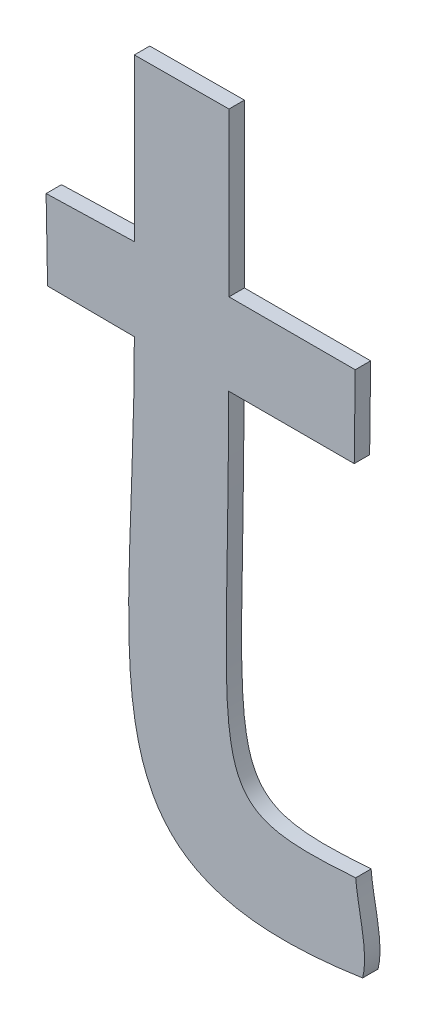
ISO-10303-21;
HEADER;
FILE_DESCRIPTION(('STEP AP214'),'2;1');
FILE_NAME('part.step','',(''),(''),'','','');
FILE_SCHEMA(('AUTOMOTIVE_DESIGN { 1 0 10303 214 1 1 1 1 }'));
ENDSEC;
DATA;
#1=APPLICATION_CONTEXT('core data for automotive mechanical design processes');
#2=APPLICATION_PROTOCOL_DEFINITION('international standard','automotive_design',2000,#1);
#3=PRODUCT_CONTEXT('',#1,'mechanical');
#4=PRODUCT('Part','Part','',(#3));
#5=PRODUCT_RELATED_PRODUCT_CATEGORY('part','',(#4));
#6=PRODUCT_DEFINITION_FORMATION('','',#4);
#7=PRODUCT_DEFINITION_CONTEXT('part definition',#1,'design');
#8=PRODUCT_DEFINITION('design','',#6,#7);
#9=PRODUCT_DEFINITION_SHAPE('','',#8);
#10=(LENGTH_UNIT() NAMED_UNIT(*) SI_UNIT(.MILLI.,.METRE.));
#11=(NAMED_UNIT(*) PLANE_ANGLE_UNIT() SI_UNIT($,.RADIAN.));
#12=(NAMED_UNIT(*) SI_UNIT($,.STERADIAN.) SOLID_ANGLE_UNIT());
#13=UNCERTAINTY_MEASURE_WITH_UNIT(LENGTH_MEASURE(1.E-05),#10,'distance_accuracy_value','');
#14=(GEOMETRIC_REPRESENTATION_CONTEXT(3) GLOBAL_UNCERTAINTY_ASSIGNED_CONTEXT((#13)) GLOBAL_UNIT_ASSIGNED_CONTEXT((#10,
#11,#12)) REPRESENTATION_CONTEXT('',''));
#15=CARTESIAN_POINT('',(0.,0.,0.));
#16=DIRECTION('',(0.,0.,1.));
#17=DIRECTION('',(1.,0.,0.));
#18=AXIS2_PLACEMENT_3D('',#15,#16,#17);
#19=CARTESIAN_POINT('',(-1.914125859375,-48.6386512109375,0.001));
#20=CARTESIAN_POINT('',(-1.914125859375,-48.6386512109375,0.));
#21=CARTESIAN_POINT('',(-1.9137099609375,-48.637019609375,0.001));
#22=CARTESIAN_POINT('',(-1.9137099609375,-48.637019609375,0.));
#23=CARTESIAN_POINT('',(-1.91444578125,-48.6349401171875,0.001));
#24=CARTESIAN_POINT('',(-1.91444578125,-48.6349401171875,0.));
#25=CARTESIAN_POINT('',(-1.91457375,-48.63324453125,0.001));
#26=CARTESIAN_POINT('',(-1.91457375,-48.63324453125,0.));
#27=B_SPLINE_SURFACE_WITH_KNOTS('',3,1,((#19,#20),(#21,#22),(#23,#24),(#25,#26)),.UNSPECIFIED.,
.F.,.F.,.F.,(4,4),(2,2),(0.153846153846154,0.230769230769231),(0.,1.),.UNSPECIFIED.);
#28=CARTESIAN_POINT('',(-1.914125859375,-48.6386512109375,0.));
#29=CARTESIAN_POINT('',(-1.9137099609375,-48.637019609375,0.));
#30=CARTESIAN_POINT('',(-1.91444578125,-48.6349401171875,0.));
#31=CARTESIAN_POINT('',(-1.91457375,-48.63324453125,0.));
#32=B_SPLINE_CURVE_WITH_KNOTS('',3,(#28,#29,#30,#31),.UNSPECIFIED.,.F.,.F.,(4,4),
(0.153846153846154,0.230769230769231),.UNSPECIFIED.);
#33=CARTESIAN_POINT('',(-1.914125859375,-48.6386512109375,0.));
#34=VERTEX_POINT('',#33);
#35=CARTESIAN_POINT('',(-1.91457375,-48.63324453125,0.));
#36=VERTEX_POINT('',#35);
#37=EDGE_CURVE('E11',#34,#36,#32,.T.);
#38=DIRECTION('',(0.,0.,-1.));
#39=VECTOR('',#38,1.);
#40=CARTESIAN_POINT('',(-1.91457375,-48.63324453125,0.001));
#41=LINE('',#40,#39);
#42=CARTESIAN_POINT('',(-1.91457375,-48.63324453125,0.001));
#43=VERTEX_POINT('',#42);
#44=EDGE_CURVE('E28',#43,#36,#41,.T.);
#45=CARTESIAN_POINT('',(-1.914125859375,-48.6386512109375,0.001));
#46=CARTESIAN_POINT('',(-1.9137099609375,-48.637019609375,0.001));
#47=CARTESIAN_POINT('',(-1.91444578125,-48.6349401171875,0.001));
#48=CARTESIAN_POINT('',(-1.91457375,-48.63324453125,0.001));
#49=B_SPLINE_CURVE_WITH_KNOTS('',3,(#45,#46,#47,#48),.UNSPECIFIED.,.F.,.F.,(4,4),
(0.153846153846154,0.230769230769231),.UNSPECIFIED.);
#50=CARTESIAN_POINT('',(-1.914125859375,-48.6386512109375,0.001));
#51=VERTEX_POINT('',#50);
#52=EDGE_CURVE('E223',#51,#43,#49,.T.);
#53=DIRECTION('',(0.,0.,-1.));
#54=VECTOR('',#53,1.);
#55=CARTESIAN_POINT('',(-1.914125859375,-48.6386512109375,0.001));
#56=LINE('',#55,#54);
#57=EDGE_CURVE('E40',#51,#34,#56,.T.);
#58=ORIENTED_EDGE('',*,*,#37,.T.);
#59=ORIENTED_EDGE('',*,*,#44,.F.);
#60=ORIENTED_EDGE('',*,*,#52,.F.);
#61=ORIENTED_EDGE('',*,*,#57,.T.);
#62=EDGE_LOOP('',(#58,#59,#60,#61));
#63=FACE_BOUND('',#62,.T.);
#64=ADVANCED_FACE('F17',(#63),#27,.F.);
#65=CARTESIAN_POINT('',(-1.91457375,-48.63324453125,0.001));
#66=CARTESIAN_POINT('',(-1.91457375,-48.63324453125,0.));
#67=CARTESIAN_POINT('',(-1.924875234375,-48.6339803515625,0.001));
#68=CARTESIAN_POINT('',(-1.924875234375,-48.6339803515625,0.));
#69=CARTESIAN_POINT('',(-1.9227957421875,-48.632284765625,0.001));
#70=CARTESIAN_POINT('',(-1.9227957421875,-48.632284765625,0.));
#71=CARTESIAN_POINT('',(-1.922827734375,-48.610018203125,0.001));
#72=CARTESIAN_POINT('',(-1.922827734375,-48.610018203125,0.));
#73=B_SPLINE_SURFACE_WITH_KNOTS('',3,1,((#65,#66),(#67,#68),(#69,#70),(#71,#72)),.UNSPECIFIED.,
.F.,.F.,.F.,(4,4),(2,2),(0.230769230769231,0.307692307692308),(0.,1.),.UNSPECIFIED.);
#74=CARTESIAN_POINT('',(-1.91457375,-48.63324453125,0.));
#75=CARTESIAN_POINT('',(-1.924875234375,-48.6339803515625,0.));
#76=CARTESIAN_POINT('',(-1.9227957421875,-48.632284765625,0.));
#77=CARTESIAN_POINT('',(-1.922827734375,-48.610018203125,0.));
#78=B_SPLINE_CURVE_WITH_KNOTS('',3,(#74,#75,#76,#77),.UNSPECIFIED.,.F.,.F.,(4,4),
(0.230769230769231,0.307692307692308),.UNSPECIFIED.);
#79=CARTESIAN_POINT('',(-1.922827734375,-48.610018203125,0.));
#80=VERTEX_POINT('',#79);
#81=EDGE_CURVE('E215',#36,#80,#78,.T.);
#82=DIRECTION('',(0.,0.,-1.));
#83=VECTOR('',#82,1.);
#84=CARTESIAN_POINT('',(-1.922827734375,-48.610018203125,0.001));
#85=LINE('',#84,#83);
#86=CARTESIAN_POINT('',(-1.922827734375,-48.610018203125,0.001));
#87=VERTEX_POINT('',#86);
#88=EDGE_CURVE('E210',#87,#80,#85,.T.);
#89=CARTESIAN_POINT('',(-1.91457375,-48.63324453125,0.001));
#90=CARTESIAN_POINT('',(-1.924875234375,-48.6339803515625,0.001));
#91=CARTESIAN_POINT('',(-1.9227957421875,-48.632284765625,0.001));
#92=CARTESIAN_POINT('',(-1.922827734375,-48.610018203125,0.001));
#93=B_SPLINE_CURVE_WITH_KNOTS('',3,(#89,#90,#91,#92),.UNSPECIFIED.,.F.,.F.,(4,4),
(0.230769230769231,0.307692307692308),.UNSPECIFIED.);
#94=EDGE_CURVE('E206',#43,#87,#93,.T.);
#95=ORIENTED_EDGE('',*,*,#81,.T.);
#96=ORIENTED_EDGE('',*,*,#88,.F.);
#97=ORIENTED_EDGE('',*,*,#94,.F.);
#98=ORIENTED_EDGE('',*,*,#44,.T.);
#99=EDGE_LOOP('',(#95,#96,#97,#98));
#100=FACE_BOUND('',#99,.T.);
#101=ADVANCED_FACE('F231',(#100),#73,.F.);
#102=CARTESIAN_POINT('',(0.,-48.610018203125,0.001));
#103=DIRECTION('',(0.,1.,0.));
#104=DIRECTION('',(0.,0.,1.));
#105=AXIS2_PLACEMENT_3D('',#102,#103,#104);
#106=PLANE('',#105);
#107=DIRECTION('',(1.,0.,0.));
#108=VECTOR('',#107,1.);
#109=CARTESIAN_POINT('',(0.,-48.610018203125,0.));
#110=LINE('',#109,#108);
#111=CARTESIAN_POINT('',(-1.9146697265625,-48.610018203125,0.));
#112=VERTEX_POINT('',#111);
#113=EDGE_CURVE('E204',#80,#112,#110,.T.);
#114=ORIENTED_EDGE('',*,*,#113,.T.);
#115=DIRECTION('',(0.,0.,-1.));
#116=VECTOR('',#115,1.);
#117=CARTESIAN_POINT('',(-1.9146697265625,-48.610018203125,0.001));
#118=LINE('',#117,#116);
#119=CARTESIAN_POINT('',(-1.9146697265625,-48.610018203125,0.001));
#120=VERTEX_POINT('',#119);
#121=EDGE_CURVE('E201',#120,#112,#118,.T.);
#122=ORIENTED_EDGE('',*,*,#121,.F.);
#123=DIRECTION('',(1.,0.,0.));
#124=VECTOR('',#123,1.);
#125=CARTESIAN_POINT('',(0.,-48.610018203125,0.001));
#126=LINE('',#125,#124);
#127=EDGE_CURVE('E198',#87,#120,#126,.T.);
#128=ORIENTED_EDGE('',*,*,#127,.F.);
#129=ORIENTED_EDGE('',*,*,#88,.T.);
#130=EDGE_LOOP('',(#114,#122,#128,#129));
#131=FACE_BOUND('',#130,.T.);
#132=ADVANCED_FACE('F235',(#131),#106,.F.);
#133=CARTESIAN_POINT('',(-1.3288139674007,0.0160098068363072,0.001));
#134=DIRECTION('',(-0.999927428426189,0.0120473184148894,0.));
#135=DIRECTION('',(-0.0120473184148894,-0.999927428426189,0.));
#136=AXIS2_PLACEMENT_3D('',#133,#134,#135);
#137=PLANE('',#136);
#138=DIRECTION('',(0.0120473184148894,0.999927428426189,0.));
#139=VECTOR('',#138,1.);
#140=CARTESIAN_POINT('',(-1.3288139674007,0.0160098068363072,0.));
#141=LINE('',#140,#139);
#142=CARTESIAN_POINT('',(-1.9146057421875,-48.6047075,0.));
#143=VERTEX_POINT('',#142);
#144=EDGE_CURVE('E196',#112,#143,#141,.T.);
#145=ORIENTED_EDGE('',*,*,#144,.T.);
#146=DIRECTION('',(0.,0.,-1.));
#147=VECTOR('',#146,1.);
#148=CARTESIAN_POINT('',(-1.9146057421875,-48.6047075,0.001));
#149=LINE('',#148,#147);
#150=CARTESIAN_POINT('',(-1.9146057421875,-48.6047075,0.001));
#151=VERTEX_POINT('',#150);
#152=EDGE_CURVE('E193',#151,#143,#149,.T.);
#153=ORIENTED_EDGE('',*,*,#152,.F.);
#154=DIRECTION('',(0.0120473184148894,0.999927428426189,0.));
#155=VECTOR('',#154,1.);
#156=CARTESIAN_POINT('',(-1.3288139674007,0.0160098068363072,0.001));
#157=LINE('',#156,#155);
#158=EDGE_CURVE('E190',#120,#151,#157,.T.);
#159=ORIENTED_EDGE('',*,*,#158,.F.);
#160=ORIENTED_EDGE('',*,*,#121,.T.);
#161=EDGE_LOOP('',(#145,#153,#159,#160));
#162=FACE_BOUND('',#161,.T.);
#163=ADVANCED_FACE('F239',(#162),#137,.F.);
#164=CARTESIAN_POINT('',(0.,-48.6047075,0.001));
#165=DIRECTION('',(0.,-1.,0.));
#166=DIRECTION('',(0.,0.,-1.));
#167=AXIS2_PLACEMENT_3D('',#164,#165,#166);
#168=PLANE('',#167);
#169=DIRECTION('',(-1.,0.,0.));
#170=VECTOR('',#169,1.);
#171=CARTESIAN_POINT('',(0.,-48.6047075,0.));
#172=LINE('',#171,#170);
#173=CARTESIAN_POINT('',(-1.9227957421875,-48.6047075,0.));
#174=VERTEX_POINT('',#173);
#175=EDGE_CURVE('E188',#143,#174,#172,.T.);
#176=ORIENTED_EDGE('',*,*,#175,.T.);
#177=DIRECTION('',(0.,0.,-1.));
#178=VECTOR('',#177,1.);
#179=CARTESIAN_POINT('',(-1.9227957421875,-48.6047075,0.001));
#180=LINE('',#179,#178);
#181=CARTESIAN_POINT('',(-1.9227957421875,-48.6047075,0.001));
#182=VERTEX_POINT('',#181);
#183=EDGE_CURVE('E185',#182,#174,#180,.T.);
#184=ORIENTED_EDGE('',*,*,#183,.F.);
#185=DIRECTION('',(-1.,0.,0.));
#186=VECTOR('',#185,1.);
#187=CARTESIAN_POINT('',(0.,-48.6047075,0.001));
#188=LINE('',#187,#186);
#189=EDGE_CURVE('E182',#151,#182,#188,.T.);
#190=ORIENTED_EDGE('',*,*,#189,.F.);
#191=ORIENTED_EDGE('',*,*,#152,.T.);
#192=EDGE_LOOP('',(#176,#184,#190,#191));
#193=FACE_BOUND('',#192,.T.);
#194=ADVANCED_FACE('F243',(#193),#168,.F.);
#195=CARTESIAN_POINT('',(-1.9227957421875,0.,0.001));
#196=DIRECTION('',(-1.,0.,0.));
#197=DIRECTION('',(0.,0.,1.));
#198=AXIS2_PLACEMENT_3D('',#195,#196,#197);
#199=PLANE('',#198);
#200=DIRECTION('',(0.,1.,0.));
#201=VECTOR('',#200,1.);
#202=CARTESIAN_POINT('',(-1.9227957421875,0.,0.));
#203=LINE('',#202,#201);
#204=CARTESIAN_POINT('',(-1.9227957421875,-48.594150078125,0.));
#205=VERTEX_POINT('',#204);
#206=EDGE_CURVE('E180',#174,#205,#203,.T.);
#207=ORIENTED_EDGE('',*,*,#206,.T.);
#208=DIRECTION('',(0.,0.,-1.));
#209=VECTOR('',#208,1.);
#210=CARTESIAN_POINT('',(-1.9227957421875,-48.594150078125,0.001));
#211=LINE('',#210,#209);
#212=CARTESIAN_POINT('',(-1.9227957421875,-48.594150078125,0.001));
#213=VERTEX_POINT('',#212);
#214=EDGE_CURVE('E177',#213,#205,#211,.T.);
#215=ORIENTED_EDGE('',*,*,#214,.F.);
#216=DIRECTION('',(0.,1.,0.));
#217=VECTOR('',#216,1.);
#218=CARTESIAN_POINT('',(-1.9227957421875,0.,0.001));
#219=LINE('',#218,#217);
#220=EDGE_CURVE('E174',#182,#213,#219,.T.);
#221=ORIENTED_EDGE('',*,*,#220,.F.);
#222=ORIENTED_EDGE('',*,*,#183,.T.);
#223=EDGE_LOOP('',(#207,#215,#221,#222));
#224=FACE_BOUND('',#223,.T.);
#225=ADVANCED_FACE('F250',(#224),#199,.F.);
#226=CARTESIAN_POINT('',(0.253035508428184,-48.582817623696,0.001));
#227=DIRECTION('',(0.0052082626916406,-0.999986436907889,0.));
#228=DIRECTION('',(0.999986436907889,0.0052082626916406,0.));
#229=AXIS2_PLACEMENT_3D('',#226,#227,#228);
#230=PLANE('',#229);
#231=DIRECTION('',(-0.999986436907889,-0.0052082626916406,0.));
#232=VECTOR('',#231,1.);
#233=CARTESIAN_POINT('',(0.253035508428184,-48.582817623696,0.));
#234=LINE('',#233,#232);
#235=CARTESIAN_POINT('',(-1.9289382421875,-48.5941820703125,0.));
#236=VERTEX_POINT('',#235);
#237=EDGE_CURVE('E172',#205,#236,#234,.T.);
#238=ORIENTED_EDGE('',*,*,#237,.T.);
#239=DIRECTION('',(0.,0.,-1.));
#240=VECTOR('',#239,1.);
#241=CARTESIAN_POINT('',(-1.9289382421875,-48.5941820703125,0.001));
#242=LINE('',#241,#240);
#243=CARTESIAN_POINT('',(-1.9289382421875,-48.5941820703125,0.001));
#244=VERTEX_POINT('',#243);
#245=EDGE_CURVE('E169',#244,#236,#242,.T.);
#246=ORIENTED_EDGE('',*,*,#245,.F.);
#247=DIRECTION('',(-0.999986436907889,-0.0052082626916406,0.));
#248=VECTOR('',#247,1.);
#249=CARTESIAN_POINT('',(0.253035508428184,-48.582817623696,0.001));
#250=LINE('',#249,#248);
#251=EDGE_CURVE('E166',#213,#244,#250,.T.);
#252=ORIENTED_EDGE('',*,*,#251,.F.);
#253=ORIENTED_EDGE('',*,*,#214,.T.);
#254=EDGE_LOOP('',(#238,#246,#252,#253));
#255=FACE_BOUND('',#254,.T.);
#256=ADVANCED_FACE('F254',(#255),#230,.F.);
#257=CARTESIAN_POINT('',(-1.9289382421875,0.,0.001));
#258=DIRECTION('',(1.,0.,0.));
#259=DIRECTION('',(0.,0.,-1.));
#260=AXIS2_PLACEMENT_3D('',#257,#258,#259);
#261=PLANE('',#260);
#262=DIRECTION('',(0.,-1.,0.));
#263=VECTOR('',#262,1.);
#264=CARTESIAN_POINT('',(-1.9289382421875,0.,0.));
#265=LINE('',#264,#263);
#266=CARTESIAN_POINT('',(-1.9289382421875,-48.6046755078125,0.));
#267=VERTEX_POINT('',#266);
#268=EDGE_CURVE('E164',#236,#267,#265,.T.);
#269=ORIENTED_EDGE('',*,*,#268,.T.);
#270=DIRECTION('',(0.,0.,-1.));
#271=VECTOR('',#270,1.);
#272=CARTESIAN_POINT('',(-1.9289382421875,-48.6046755078125,0.001));
#273=LINE('',#272,#271);
#274=CARTESIAN_POINT('',(-1.9289382421875,-48.6046755078125,0.001));
#275=VERTEX_POINT('',#274);
#276=EDGE_CURVE('E161',#275,#267,#273,.T.);
#277=ORIENTED_EDGE('',*,*,#276,.F.);
#278=DIRECTION('',(0.,-1.,0.));
#279=VECTOR('',#278,1.);
#280=CARTESIAN_POINT('',(-1.9289382421875,0.,0.001));
#281=LINE('',#280,#279);
#282=EDGE_CURVE('E158',#244,#275,#281,.T.);
#283=ORIENTED_EDGE('',*,*,#282,.F.);
#284=ORIENTED_EDGE('',*,*,#245,.T.);
#285=EDGE_LOOP('',(#269,#277,#283,#284));
#286=FACE_BOUND('',#285,.T.);
#287=ADVANCED_FACE('F258',(#286),#261,.F.);
#288=CARTESIAN_POINT('',(1.3551101204486,-48.5129423133278,0.001));
#289=DIRECTION('',(0.0279220699153596,-0.999610102995984,0.));
#290=DIRECTION('',(0.999610102995984,0.0279220699153596,0.));
#291=AXIS2_PLACEMENT_3D('',#288,#289,#290);
#292=PLANE('',#291);
#293=DIRECTION('',(-0.999610102995984,-0.0279220699153596,0.));
#294=VECTOR('',#293,1.);
#295=CARTESIAN_POINT('',(1.3551101204486,-48.5129423133278,0.));
#296=LINE('',#295,#294);
#297=CARTESIAN_POINT('',(-1.93466484375,-48.60483546875,0.));
#298=VERTEX_POINT('',#297);
#299=EDGE_CURVE('E156',#267,#298,#296,.T.);
#300=ORIENTED_EDGE('',*,*,#299,.T.);
#301=DIRECTION('',(0.,0.,-1.));
#302=VECTOR('',#301,1.);
#303=CARTESIAN_POINT('',(-1.93466484375,-48.60483546875,0.001));
#304=LINE('',#303,#302);
#305=CARTESIAN_POINT('',(-1.93466484375,-48.60483546875,0.001));
#306=VERTEX_POINT('',#305);
#307=EDGE_CURVE('E153',#306,#298,#304,.T.);
#308=ORIENTED_EDGE('',*,*,#307,.F.);
#309=DIRECTION('',(-0.999610102995984,-0.0279220699153596,0.));
#310=VECTOR('',#309,1.);
#311=CARTESIAN_POINT('',(1.3551101204486,-48.5129423133278,0.001));
#312=LINE('',#311,#310);
#313=EDGE_CURVE('E151',#275,#306,#312,.T.);
#314=ORIENTED_EDGE('',*,*,#313,.F.);
#315=ORIENTED_EDGE('',*,*,#276,.T.);
#316=EDGE_LOOP('',(#300,#308,#314,#315));
#317=FACE_BOUND('',#316,.T.);
#318=ADVANCED_FACE('F261',(#317),#292,.F.);
#319=CARTESIAN_POINT('',(-2.8393591572019,-0.0529073134882239,0.001));
#320=DIRECTION('',(0.999826440781252,0.0186303063499576,0.));
#321=DIRECTION('',(-0.0186303063499576,0.999826440781252,0.));
#322=AXIS2_PLACEMENT_3D('',#319,#320,#321);
#323=PLANE('',#322);
#324=DIRECTION('',(0.0186303063499576,-0.999826440781252,0.));
#325=VECTOR('',#324,1.);
#326=CARTESIAN_POINT('',(-2.8393591572019,-0.0529073134882239,0.));
#327=LINE('',#326,#325);
#328=CARTESIAN_POINT('',(-1.9345688671875,-48.6099862109375,0.));
#329=VERTEX_POINT('',#328);
#330=EDGE_CURVE('E149',#298,#329,#327,.T.);
#331=ORIENTED_EDGE('',*,*,#330,.T.);
#332=DIRECTION('',(0.,0.,-1.));
#333=VECTOR('',#332,1.);
#334=CARTESIAN_POINT('',(-1.9345688671875,-48.6099862109375,0.001));
#335=LINE('',#334,#333);
#336=CARTESIAN_POINT('',(-1.9345688671875,-48.6099862109375,0.001));
#337=VERTEX_POINT('',#336);
#338=EDGE_CURVE('E147',#337,#329,#335,.T.);
#339=ORIENTED_EDGE('',*,*,#338,.F.);
#340=DIRECTION('',(0.0186303063499576,-0.999826440781252,0.));
#341=VECTOR('',#340,1.);
#342=CARTESIAN_POINT('',(-2.8393591572019,-0.0529073134882239,0.001));
#343=LINE('',#342,#341);
#344=EDGE_CURVE('E128',#306,#337,#343,.T.);
#345=ORIENTED_EDGE('',*,*,#344,.F.);
#346=ORIENTED_EDGE('',*,*,#307,.T.);
#347=EDGE_LOOP('',(#331,#339,#345,#346));
#348=FACE_BOUND('',#347,.T.);
#349=ADVANCED_FACE('F264',(#348),#323,.F.);
#350=CARTESIAN_POINT('',(-0.276246639152472,-48.619408496323,0.001));
#351=DIRECTION('',(0.0056817264701649,0.999983858861891,0.));
#352=DIRECTION('',(-0.999983858861891,0.0056817264701649,0.));
#353=AXIS2_PLACEMENT_3D('',#350,#351,#352);
#354=PLANE('',#353);
#355=DIRECTION('',(0.999983858861891,-0.0056817264701649,0.));
#356=VECTOR('',#355,1.);
#357=CARTESIAN_POINT('',(-0.276246639152472,-48.619408496323,0.));
#358=LINE('',#357,#356);
#359=CARTESIAN_POINT('',(-1.9289382421875,-48.610018203125,0.));
#360=VERTEX_POINT('',#359);
#361=EDGE_CURVE('E115',#329,#360,#358,.T.);
#362=ORIENTED_EDGE('',*,*,#361,.T.);
#363=DIRECTION('',(0.,0.,-1.));
#364=VECTOR('',#363,1.);
#365=CARTESIAN_POINT('',(-1.9289382421875,-48.610018203125,0.001));
#366=LINE('',#365,#364);
#367=CARTESIAN_POINT('',(-1.9289382421875,-48.610018203125,0.001));
#368=VERTEX_POINT('',#367);
#369=EDGE_CURVE('E109',#368,#360,#366,.T.);
#370=ORIENTED_EDGE('',*,*,#369,.F.);
#371=DIRECTION('',(0.999983858861891,-0.0056817264701649,0.));
#372=VECTOR('',#371,1.);
#373=CARTESIAN_POINT('',(-0.276246639152472,-48.619408496323,0.001));
#374=LINE('',#373,#372);
#375=EDGE_CURVE('E113',#337,#368,#374,.T.);
#376=ORIENTED_EDGE('',*,*,#375,.F.);
#377=ORIENTED_EDGE('',*,*,#338,.T.);
#378=EDGE_LOOP('',(#362,#370,#376,#377));
#379=FACE_BOUND('',#378,.T.);
#380=ADVANCED_FACE('F111',(#379),#354,.F.);
#381=CARTESIAN_POINT('',(-1.9289382421875,-48.610018203125,0.001));
#382=CARTESIAN_POINT('',(-1.9289382421875,-48.610018203125,0.));
#383=CARTESIAN_POINT('',(-1.9289382421875,-48.629981328125,0.001));
#384=CARTESIAN_POINT('',(-1.9289382421875,-48.629981328125,0.));
#385=CARTESIAN_POINT('',(-1.93300125,-48.641498515625,0.001));
#386=CARTESIAN_POINT('',(-1.93300125,-48.641498515625,0.));
#387=CARTESIAN_POINT('',(-1.914125859375,-48.6386512109375,0.001));
#388=CARTESIAN_POINT('',(-1.914125859375,-48.6386512109375,0.));
#389=B_SPLINE_SURFACE_WITH_KNOTS('',3,1,((#381,#382),(#383,#384),(#385,#386),(#387,#388)),
.UNSPECIFIED.,.F.,.F.,.F.,(4,4),(2,2),(0.0769230769230769,0.153846153846154),(0.,1.),.UNSPECIFIED.);
#390=CARTESIAN_POINT('',(-1.9289382421875,-48.610018203125,0.));
#391=CARTESIAN_POINT('',(-1.9289382421875,-48.629981328125,0.));
#392=CARTESIAN_POINT('',(-1.93300125,-48.641498515625,0.));
#393=CARTESIAN_POINT('',(-1.914125859375,-48.6386512109375,0.));
#394=B_SPLINE_CURVE_WITH_KNOTS('',3,(#390,#391,#392,#393),.UNSPECIFIED.,.F.,.F.,(4,4),
(0.0769230769230769,0.153846153846154),.UNSPECIFIED.);
#395=EDGE_CURVE('E129',#360,#34,#394,.T.);
#396=CARTESIAN_POINT('',(-1.9289382421875,-48.610018203125,0.001));
#397=CARTESIAN_POINT('',(-1.9289382421875,-48.629981328125,0.001));
#398=CARTESIAN_POINT('',(-1.93300125,-48.641498515625,0.001));
#399=CARTESIAN_POINT('',(-1.914125859375,-48.6386512109375,0.001));
#400=B_SPLINE_CURVE_WITH_KNOTS('',3,(#396,#397,#398,#399),.UNSPECIFIED.,.F.,.F.,(4,4),
(0.0769230769230769,0.153846153846154),.UNSPECIFIED.);
#401=EDGE_CURVE('E125',#368,#51,#400,.T.);
#402=ORIENTED_EDGE('',*,*,#395,.T.);
#403=ORIENTED_EDGE('',*,*,#57,.F.);
#404=ORIENTED_EDGE('',*,*,#401,.F.);
#405=ORIENTED_EDGE('',*,*,#369,.T.);
#406=EDGE_LOOP('',(#402,#403,#404,#405));
#407=FACE_BOUND('',#406,.T.);
#408=ADVANCED_FACE('F131',(#407),#389,.F.);
#409=CARTESIAN_POINT('',(0.,0.,0.001));
#410=DIRECTION('',(0.,0.,1.));
#411=DIRECTION('',(1.,0.,0.));
#412=AXIS2_PLACEMENT_3D('',#409,#410,#411);
#413=PLANE('',#412);
#414=ORIENTED_EDGE('',*,*,#52,.T.);
#415=ORIENTED_EDGE('',*,*,#94,.T.);
#416=ORIENTED_EDGE('',*,*,#127,.T.);
#417=ORIENTED_EDGE('',*,*,#158,.T.);
#418=ORIENTED_EDGE('',*,*,#189,.T.);
#419=ORIENTED_EDGE('',*,*,#220,.T.);
#420=ORIENTED_EDGE('',*,*,#251,.T.);
#421=ORIENTED_EDGE('',*,*,#282,.T.);
#422=ORIENTED_EDGE('',*,*,#313,.T.);
#423=ORIENTED_EDGE('',*,*,#344,.T.);
#424=ORIENTED_EDGE('',*,*,#375,.T.);
#425=ORIENTED_EDGE('',*,*,#401,.T.);
#426=EDGE_LOOP('',(#414,#415,#416,#417,#418,#419,#420,#421,#422,#423,#424,#425));
#427=FACE_BOUND('',#426,.T.);
#428=ADVANCED_FACE('F124',(#427),#413,.T.);
#429=CARTESIAN_POINT('',(0.,0.,0.));
#430=DIRECTION('',(0.,0.,1.));
#431=DIRECTION('',(1.,0.,0.));
#432=AXIS2_PLACEMENT_3D('',#429,#430,#431);
#433=PLANE('',#432);
#434=ORIENTED_EDGE('',*,*,#37,.F.);
#435=ORIENTED_EDGE('',*,*,#395,.F.);
#436=ORIENTED_EDGE('',*,*,#361,.F.);
#437=ORIENTED_EDGE('',*,*,#330,.F.);
#438=ORIENTED_EDGE('',*,*,#299,.F.);
#439=ORIENTED_EDGE('',*,*,#268,.F.);
#440=ORIENTED_EDGE('',*,*,#237,.F.);
#441=ORIENTED_EDGE('',*,*,#206,.F.);
#442=ORIENTED_EDGE('',*,*,#175,.F.);
#443=ORIENTED_EDGE('',*,*,#144,.F.);
#444=ORIENTED_EDGE('',*,*,#113,.F.);
#445=ORIENTED_EDGE('',*,*,#81,.F.);
#446=EDGE_LOOP('',(#434,#435,#436,#437,#438,#439,#440,#441,#442,#443,#444,#445));
#447=FACE_BOUND('',#446,.T.);
#448=ADVANCED_FACE('F246',(#447),#433,.F.);
#449=CLOSED_SHELL('',(#64,#101,#132,#163,#194,#225,#256,#287,#318,#349,#380,#408,#428,#448));
#450=MANIFOLD_SOLID_BREP('B1',#449);
#451=ADVANCED_BREP_SHAPE_REPRESENTATION('',(#18,#450),#14);
#452=SHAPE_DEFINITION_REPRESENTATION(#9,#451);
ENDSEC;
END-ISO-10303-21;
